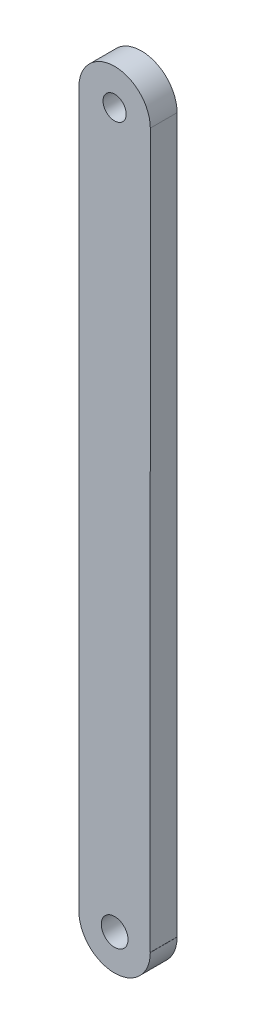
ISO-10303-21;
HEADER;
FILE_DESCRIPTION(('STEP AP214'),'2;1');
FILE_NAME('part.step','',(''),(''),'','','');
FILE_SCHEMA(('AUTOMOTIVE_DESIGN { 1 0 10303 214 1 1 1 1 }'));
ENDSEC;
DATA;
#1=APPLICATION_CONTEXT('core data for automotive mechanical design processes');
#2=APPLICATION_PROTOCOL_DEFINITION('international standard','automotive_design',2000,#1);
#3=PRODUCT_CONTEXT('',#1,'mechanical');
#4=PRODUCT('Part','Part','',(#3));
#5=PRODUCT_RELATED_PRODUCT_CATEGORY('part','',(#4));
#6=PRODUCT_DEFINITION_FORMATION('','',#4);
#7=PRODUCT_DEFINITION_CONTEXT('part definition',#1,'design');
#8=PRODUCT_DEFINITION('design','',#6,#7);
#9=PRODUCT_DEFINITION_SHAPE('','',#8);
#10=(LENGTH_UNIT() NAMED_UNIT(*) SI_UNIT(.MILLI.,.METRE.));
#11=(NAMED_UNIT(*) PLANE_ANGLE_UNIT() SI_UNIT($,.RADIAN.));
#12=(NAMED_UNIT(*) SI_UNIT($,.STERADIAN.) SOLID_ANGLE_UNIT());
#13=UNCERTAINTY_MEASURE_WITH_UNIT(LENGTH_MEASURE(1.E-05),#10,'distance_accuracy_value','');
#14=(GEOMETRIC_REPRESENTATION_CONTEXT(3) GLOBAL_UNCERTAINTY_ASSIGNED_CONTEXT((#13)) GLOBAL_UNIT_ASSIGNED_CONTEXT((#10,
#11,#12)) REPRESENTATION_CONTEXT('',''));
#15=CARTESIAN_POINT('',(0.,0.,0.));
#16=DIRECTION('',(0.,0.,1.));
#17=DIRECTION('',(1.,0.,0.));
#18=AXIS2_PLACEMENT_3D('',#15,#16,#17);
#19=CARTESIAN_POINT('',(51.4999999987979,80.0001000004622,3.));
#20=DIRECTION('',(0.,0.,1.));
#21=DIRECTION('',(1.,0.,0.));
#22=AXIS2_PLACEMENT_3D('',#19,#20,#21);
#23=PLANE('',#22);
#24=CARTESIAN_POINT('',(51.5000999977619,4.99977620052E-05,3.));
#25=DIRECTION('',(0.,0.,1.));
#26=DIRECTION('',(1.,0.,0.));
#27=AXIS2_PLACEMENT_3D('',#24,#25,#26);
#28=CIRCLE('',#27,1.5);
#29=CARTESIAN_POINT('',(53.0000999977619,4.99977620052E-05,3.));
#30=VERTEX_POINT('',#29);
#31=EDGE_CURVE('E113',#30,#30,#28,.T.);
#32=ORIENTED_EDGE('',*,*,#31,.F.);
#33=EDGE_LOOP('',(#32));
#34=FACE_BOUND('',#33,.T.);
#35=CARTESIAN_POINT('',(51.4999999987979,80.0001000004622,3.));
#36=DIRECTION('',(0.,0.,1.));
#37=DIRECTION('',(1.,0.,0.));
#38=AXIS2_PLACEMENT_3D('',#35,#36,#37);
#39=CIRCLE('',#38,3.99989999973548);
#40=CARTESIAN_POINT('',(55.4998999982209,80.0000500009245,3.));
#41=VERTEX_POINT('',#40);
#42=CARTESIAN_POINT('',(47.5000999993749,80.00015,3.));
#43=VERTEX_POINT('',#42);
#44=EDGE_CURVE('E118',#41,#43,#39,.T.);
#45=ORIENTED_EDGE('',*,*,#44,.T.);
#46=DIRECTION('',(0.,-1.,0.));
#47=VECTOR('',#46,1.);
#48=CARTESIAN_POINT('',(47.5000999993749,80.00015,3.));
#49=LINE('',#48,#47);
#50=CARTESIAN_POINT('',(47.500099999375,4.99993777578614E-05,3.));
#51=VERTEX_POINT('',#50);
#52=EDGE_CURVE('E85',#43,#51,#49,.T.);
#53=ORIENTED_EDGE('',*,*,#52,.T.);
#54=CARTESIAN_POINT('',(51.4999999987979,4.99993777591479E-05,3.));
#55=DIRECTION('',(0.,0.,1.));
#56=DIRECTION('',(1.,0.,0.));
#57=AXIS2_PLACEMENT_3D('',#54,#55,#56);
#58=CIRCLE('',#57,3.99989999942295);
#59=CARTESIAN_POINT('',(55.4998999982209,4.99993777617958E-05,3.));
#60=VERTEX_POINT('',#59);
#61=EDGE_CURVE('E89',#51,#60,#58,.T.);
#62=ORIENTED_EDGE('',*,*,#61,.T.);
#63=DIRECTION('',(-0.999995189814114,-0.00310166868557389,0.));
#64=VECTOR('',#63,1.);
#65=CARTESIAN_POINT('',(55.4837799214738,0.,3.));
#66=LINE('',#65,#64);
#67=CARTESIAN_POINT('',(55.4837799214738,0.,3.));
#68=VERTEX_POINT('',#67);
#69=EDGE_CURVE('E93',#60,#68,#66,.T.);
#70=ORIENTED_EDGE('',*,*,#69,.T.);
#71=DIRECTION('',(0.000201500829307539,0.999999979698708,0.));
#72=VECTOR('',#71,1.);
#73=CARTESIAN_POINT('',(55.4998999982209,80.0000500009245,3.));
#74=LINE('',#73,#72);
#75=EDGE_CURVE('E51',#68,#41,#74,.T.);
#76=ORIENTED_EDGE('',*,*,#75,.T.);
#77=EDGE_LOOP('',(#45,#53,#62,#70,#76));
#78=FACE_BOUND('',#77,.T.);
#79=CARTESIAN_POINT('',(51.5000999977621,80.000049997762,3.));
#80=DIRECTION('',(0.,0.,1.));
#81=DIRECTION('',(1.,0.,0.));
#82=AXIS2_PLACEMENT_3D('',#79,#80,#81);
#83=CIRCLE('',#82,1.3);
#84=CARTESIAN_POINT('',(52.8000999977621,80.000049997762,3.));
#85=VERTEX_POINT('',#84);
#86=EDGE_CURVE('E155',#85,#85,#83,.T.);
#87=ORIENTED_EDGE('',*,*,#86,.F.);
#88=EDGE_LOOP('',(#87));
#89=FACE_BOUND('',#88,.T.);
#90=ADVANCED_FACE('F34',(#34,#78,#89),#23,.T.);
#91=CARTESIAN_POINT('',(51.4999999987979,80.0001000004622,0.));
#92=DIRECTION('',(0.,0.,1.));
#93=DIRECTION('',(1.,0.,0.));
#94=AXIS2_PLACEMENT_3D('',#91,#92,#93);
#95=PLANE('',#94);
#96=CARTESIAN_POINT('',(51.4999999987979,80.0001000004622,0.));
#97=DIRECTION('',(0.,0.,1.));
#98=DIRECTION('',(1.,0.,0.));
#99=AXIS2_PLACEMENT_3D('',#96,#97,#98);
#100=CIRCLE('',#99,3.99989999973548);
#101=CARTESIAN_POINT('',(55.4998999982209,80.0000500009245,0.));
#102=VERTEX_POINT('',#101);
#103=CARTESIAN_POINT('',(47.5000999993749,80.00015,0.));
#104=VERTEX_POINT('',#103);
#105=EDGE_CURVE('E109',#102,#104,#100,.T.);
#106=ORIENTED_EDGE('',*,*,#105,.F.);
#107=DIRECTION('',(0.000201500829307539,0.999999979698708,0.));
#108=VECTOR('',#107,1.);
#109=CARTESIAN_POINT('',(55.4998999982209,80.0000500009245,0.));
#110=LINE('',#109,#108);
#111=CARTESIAN_POINT('',(55.4837799214738,0.,0.));
#112=VERTEX_POINT('',#111);
#113=EDGE_CURVE('E77',#112,#102,#110,.T.);
#114=ORIENTED_EDGE('',*,*,#113,.F.);
#115=DIRECTION('',(-0.999995189814114,-0.00310166868557389,0.));
#116=VECTOR('',#115,1.);
#117=CARTESIAN_POINT('',(55.4837799214738,0.,0.));
#118=LINE('',#117,#116);
#119=CARTESIAN_POINT('',(55.4998999982209,4.99993777617958E-05,0.));
#120=VERTEX_POINT('',#119);
#121=EDGE_CURVE('E71',#120,#112,#118,.T.);
#122=ORIENTED_EDGE('',*,*,#121,.F.);
#123=CARTESIAN_POINT('',(51.4999999987979,4.99993777591479E-05,0.));
#124=DIRECTION('',(0.,0.,1.));
#125=DIRECTION('',(1.,0.,0.));
#126=AXIS2_PLACEMENT_3D('',#123,#124,#125);
#127=CIRCLE('',#126,3.99989999942295);
#128=CARTESIAN_POINT('',(47.500099999375,4.99993777578614E-05,0.));
#129=VERTEX_POINT('',#128);
#130=EDGE_CURVE('E100',#129,#120,#127,.T.);
#131=ORIENTED_EDGE('',*,*,#130,.F.);
#132=DIRECTION('',(0.,-1.,0.));
#133=VECTOR('',#132,1.);
#134=CARTESIAN_POINT('',(47.5000999993749,80.00015,0.));
#135=LINE('',#134,#133);
#136=EDGE_CURVE('E112',#104,#129,#135,.T.);
#137=ORIENTED_EDGE('',*,*,#136,.F.);
#138=EDGE_LOOP('',(#106,#114,#122,#131,#137));
#139=FACE_BOUND('',#138,.T.);
#140=CARTESIAN_POINT('',(51.5000999977619,4.99977620052E-05,0.));
#141=DIRECTION('',(0.,0.,1.));
#142=DIRECTION('',(1.,0.,0.));
#143=AXIS2_PLACEMENT_3D('',#140,#141,#142);
#144=CIRCLE('',#143,1.5);
#145=CARTESIAN_POINT('',(53.0000999977619,4.99977620052E-05,0.));
#146=VERTEX_POINT('',#145);
#147=EDGE_CURVE('E161',#146,#146,#144,.T.);
#148=ORIENTED_EDGE('',*,*,#147,.T.);
#149=EDGE_LOOP('',(#148));
#150=FACE_BOUND('',#149,.T.);
#151=CARTESIAN_POINT('',(51.5000999977621,80.000049997762,0.));
#152=DIRECTION('',(0.,0.,1.));
#153=DIRECTION('',(1.,0.,0.));
#154=AXIS2_PLACEMENT_3D('',#151,#152,#153);
#155=CIRCLE('',#154,1.3);
#156=CARTESIAN_POINT('',(52.8000999977621,80.000049997762,0.));
#157=VERTEX_POINT('',#156);
#158=EDGE_CURVE('E158',#157,#157,#155,.T.);
#159=ORIENTED_EDGE('',*,*,#158,.T.);
#160=EDGE_LOOP('',(#159));
#161=FACE_BOUND('',#160,.T.);
#162=ADVANCED_FACE('F122',(#139,#150,#161),#95,.F.);
#163=CARTESIAN_POINT('',(51.4999999987979,80.0001000004622,3.));
#164=DIRECTION('',(0.,0.,-1.));
#165=DIRECTION('',(-1.,0.,0.));
#166=AXIS2_PLACEMENT_3D('',#163,#164,#165);
#167=CYLINDRICAL_SURFACE('',#166,3.99989999973548);
#168=ORIENTED_EDGE('',*,*,#105,.T.);
#169=DIRECTION('',(0.,0.,-1.));
#170=VECTOR('',#169,1.);
#171=CARTESIAN_POINT('',(47.5000999993749,80.00015,3.));
#172=LINE('',#171,#170);
#173=EDGE_CURVE('E11',#43,#104,#172,.T.);
#174=ORIENTED_EDGE('',*,*,#173,.F.);
#175=ORIENTED_EDGE('',*,*,#44,.F.);
#176=DIRECTION('',(0.,0.,-1.));
#177=VECTOR('',#176,1.);
#178=CARTESIAN_POINT('',(55.4998999982209,80.0000500009245,3.));
#179=LINE('',#178,#177);
#180=EDGE_CURVE('E105',#41,#102,#179,.T.);
#181=ORIENTED_EDGE('',*,*,#180,.T.);
#182=EDGE_LOOP('',(#168,#174,#175,#181));
#183=FACE_BOUND('',#182,.T.);
#184=ADVANCED_FACE('F36',(#183),#167,.T.);
#185=CARTESIAN_POINT('',(47.5000999993749,80.00015,3.));
#186=DIRECTION('',(1.,0.,0.));
#187=DIRECTION('',(0.,1.,0.));
#188=AXIS2_PLACEMENT_3D('',#185,#186,#187);
#189=PLANE('',#188);
#190=ORIENTED_EDGE('',*,*,#136,.T.);
#191=DIRECTION('',(0.,0.,-1.));
#192=VECTOR('',#191,1.);
#193=CARTESIAN_POINT('',(47.500099999375,4.99993777578614E-05,3.));
#194=LINE('',#193,#192);
#195=EDGE_CURVE('E43',#51,#129,#194,.T.);
#196=ORIENTED_EDGE('',*,*,#195,.F.);
#197=ORIENTED_EDGE('',*,*,#52,.F.);
#198=ORIENTED_EDGE('',*,*,#173,.T.);
#199=EDGE_LOOP('',(#190,#196,#197,#198));
#200=FACE_BOUND('',#199,.T.);
#201=ADVANCED_FACE('F193',(#200),#189,.F.);
#202=CARTESIAN_POINT('',(51.4999999987979,4.99993777591479E-05,3.));
#203=DIRECTION('',(0.,0.,-1.));
#204=DIRECTION('',(-1.,0.,0.));
#205=AXIS2_PLACEMENT_3D('',#202,#203,#204);
#206=CYLINDRICAL_SURFACE('',#205,3.99989999942295);
#207=ORIENTED_EDGE('',*,*,#130,.T.);
#208=DIRECTION('',(0.,0.,-1.));
#209=VECTOR('',#208,1.);
#210=CARTESIAN_POINT('',(55.4998999982209,4.99993777617958E-05,3.));
#211=LINE('',#210,#209);
#212=EDGE_CURVE('E97',#60,#120,#211,.T.);
#213=ORIENTED_EDGE('',*,*,#212,.F.);
#214=ORIENTED_EDGE('',*,*,#61,.F.);
#215=ORIENTED_EDGE('',*,*,#195,.T.);
#216=EDGE_LOOP('',(#207,#213,#214,#215));
#217=FACE_BOUND('',#216,.T.);
#218=ADVANCED_FACE('F98',(#217),#206,.T.);
#219=CARTESIAN_POINT('',(55.4837799214738,0.,3.));
#220=DIRECTION('',(0.00310166868557389,-0.999995189814114,0.));
#221=DIRECTION('',(0.999995189814114,0.00310166868557389,0.));
#222=AXIS2_PLACEMENT_3D('',#219,#220,#221);
#223=PLANE('',#222);
#224=ORIENTED_EDGE('',*,*,#121,.T.);
#225=DIRECTION('',(0.,0.,-1.));
#226=VECTOR('',#225,1.);
#227=CARTESIAN_POINT('',(55.4837799214738,0.,3.));
#228=LINE('',#227,#226);
#229=EDGE_CURVE('E101',#68,#112,#228,.T.);
#230=ORIENTED_EDGE('',*,*,#229,.F.);
#231=ORIENTED_EDGE('',*,*,#69,.F.);
#232=ORIENTED_EDGE('',*,*,#212,.T.);
#233=EDGE_LOOP('',(#224,#230,#231,#232));
#234=FACE_BOUND('',#233,.T.);
#235=ADVANCED_FACE('F103',(#234),#223,.F.);
#236=CARTESIAN_POINT('',(55.4998999982209,80.0000500009245,3.));
#237=DIRECTION('',(-0.999999979698708,0.000201500829307539,0.));
#238=DIRECTION('',(-0.000201500829307539,-0.999999979698708,0.));
#239=AXIS2_PLACEMENT_3D('',#236,#237,#238);
#240=PLANE('',#239);
#241=ORIENTED_EDGE('',*,*,#113,.T.);
#242=ORIENTED_EDGE('',*,*,#180,.F.);
#243=ORIENTED_EDGE('',*,*,#75,.F.);
#244=ORIENTED_EDGE('',*,*,#229,.T.);
#245=EDGE_LOOP('',(#241,#242,#243,#244));
#246=FACE_BOUND('',#245,.T.);
#247=ADVANCED_FACE('F127',(#246),#240,.F.);
#248=CARTESIAN_POINT('',(51.5000999977619,4.99977620052E-05,3.));
#249=DIRECTION('',(0.,0.,-1.));
#250=DIRECTION('',(-1.,0.,0.));
#251=AXIS2_PLACEMENT_3D('',#248,#249,#250);
#252=CYLINDRICAL_SURFACE('',#251,1.5);
#253=ORIENTED_EDGE('',*,*,#31,.T.);
#254=EDGE_LOOP('',(#253));
#255=FACE_BOUND('',#254,.T.);
#256=ORIENTED_EDGE('',*,*,#147,.F.);
#257=EDGE_LOOP('',(#256));
#258=FACE_BOUND('',#257,.T.);
#259=ADVANCED_FACE('F129',(#255,#258),#252,.F.);
#260=CARTESIAN_POINT('',(51.5000999977621,80.000049997762,3.));
#261=DIRECTION('',(0.,0.,-1.));
#262=DIRECTION('',(-1.,0.,0.));
#263=AXIS2_PLACEMENT_3D('',#260,#261,#262);
#264=CYLINDRICAL_SURFACE('',#263,1.3);
#265=ORIENTED_EDGE('',*,*,#86,.T.);
#266=EDGE_LOOP('',(#265));
#267=FACE_BOUND('',#266,.T.);
#268=ORIENTED_EDGE('',*,*,#158,.F.);
#269=EDGE_LOOP('',(#268));
#270=FACE_BOUND('',#269,.T.);
#271=ADVANCED_FACE('F135',(#267,#270),#264,.F.);
#272=CLOSED_SHELL('',(#90,#162,#184,#201,#218,#235,#247,#259,#271));
#273=MANIFOLD_SOLID_BREP('B2',#272);
#274=ADVANCED_BREP_SHAPE_REPRESENTATION('',(#18,#273),#14);
#275=SHAPE_DEFINITION_REPRESENTATION(#9,#274);
ENDSEC;
END-ISO-10303-21;
